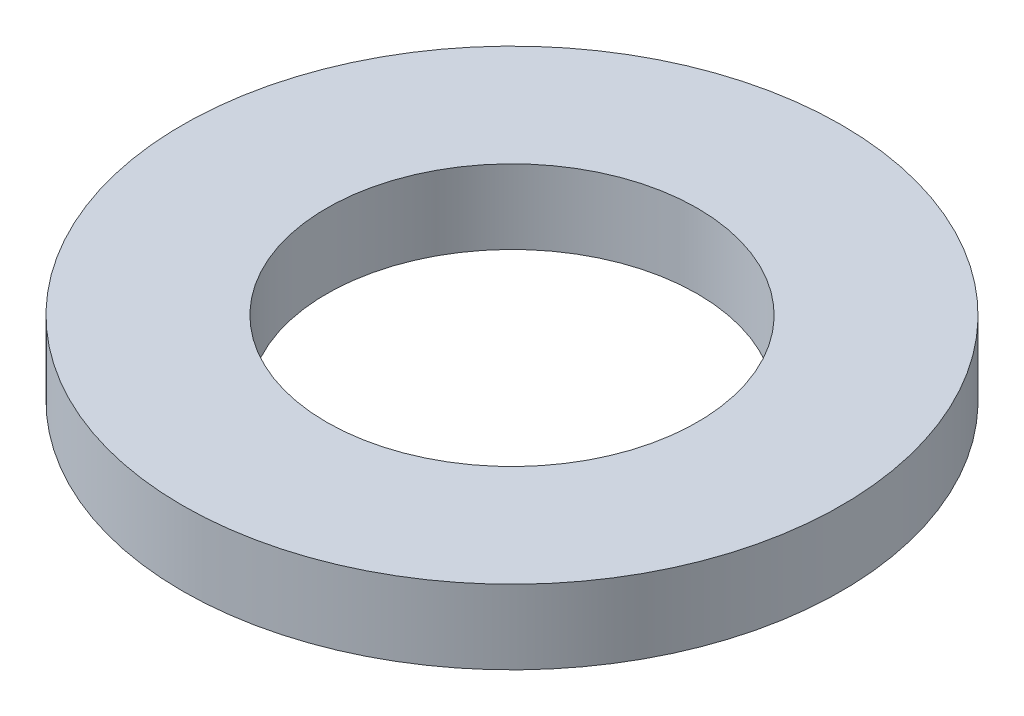
ISO-10303-21;
HEADER;
FILE_DESCRIPTION(('STEP AP214'),'2;1');
FILE_NAME('part.step','',(''),(''),'','','');
FILE_SCHEMA(('AUTOMOTIVE_DESIGN { 1 0 10303 214 1 1 1 1 }'));
ENDSEC;
DATA;
#1=APPLICATION_CONTEXT('core data for automotive mechanical design processes');
#2=APPLICATION_PROTOCOL_DEFINITION('international standard','automotive_design',2000,#1);
#3=PRODUCT_CONTEXT('',#1,'mechanical');
#4=PRODUCT('Part','Part','',(#3));
#5=PRODUCT_RELATED_PRODUCT_CATEGORY('part','',(#4));
#6=PRODUCT_DEFINITION_FORMATION('','',#4);
#7=PRODUCT_DEFINITION_CONTEXT('part definition',#1,'design');
#8=PRODUCT_DEFINITION('design','',#6,#7);
#9=PRODUCT_DEFINITION_SHAPE('','',#8);
#10=(LENGTH_UNIT() NAMED_UNIT(*) SI_UNIT(.MILLI.,.METRE.));
#11=(NAMED_UNIT(*) PLANE_ANGLE_UNIT() SI_UNIT($,.RADIAN.));
#12=(NAMED_UNIT(*) SI_UNIT($,.STERADIAN.) SOLID_ANGLE_UNIT());
#13=UNCERTAINTY_MEASURE_WITH_UNIT(LENGTH_MEASURE(1.E-05),#10,'distance_accuracy_value','');
#14=(GEOMETRIC_REPRESENTATION_CONTEXT(3) GLOBAL_UNCERTAINTY_ASSIGNED_CONTEXT((#13)) GLOBAL_UNIT_ASSIGNED_CONTEXT((#10,
#11,#12)) REPRESENTATION_CONTEXT('',''));
#15=CARTESIAN_POINT('',(0.,0.,0.));
#16=DIRECTION('',(0.,0.,1.));
#17=DIRECTION('',(1.,0.,0.));
#18=AXIS2_PLACEMENT_3D('',#15,#16,#17);
#19=CARTESIAN_POINT('',(0.,18.,0.));
#20=DIRECTION('',(0.,-1.,0.));
#21=DIRECTION('',(0.,0.,-1.));
#22=AXIS2_PLACEMENT_3D('',#19,#20,#21);
#23=CYLINDRICAL_SURFACE('',#22,80.);
#24=CARTESIAN_POINT('',(0.,18.,0.));
#25=DIRECTION('',(0.,1.,0.));
#26=DIRECTION('',(0.,0.,1.));
#27=AXIS2_PLACEMENT_3D('',#24,#25,#26);
#28=CIRCLE('',#27,80.);
#29=CARTESIAN_POINT('',(0.,18.,80.));
#30=VERTEX_POINT('',#29);
#31=EDGE_CURVE('E10',#30,#30,#28,.T.);
#32=ORIENTED_EDGE('',*,*,#31,.F.);
#33=EDGE_LOOP('',(#32));
#34=FACE_BOUND('',#33,.T.);
#35=CARTESIAN_POINT('',(0.,0.,0.));
#36=DIRECTION('',(0.,1.,0.));
#37=DIRECTION('',(0.,0.,1.));
#38=AXIS2_PLACEMENT_3D('',#35,#36,#37);
#39=CIRCLE('',#38,80.);
#40=CARTESIAN_POINT('',(0.,0.,80.));
#41=VERTEX_POINT('',#40);
#42=EDGE_CURVE('E37',#41,#41,#39,.T.);
#43=ORIENTED_EDGE('',*,*,#42,.T.);
#44=EDGE_LOOP('',(#43));
#45=FACE_BOUND('',#44,.T.);
#46=ADVANCED_FACE('F40',(#34,#45),#23,.T.);
#47=CARTESIAN_POINT('',(0.,18.,0.));
#48=DIRECTION('',(0.,1.,0.));
#49=DIRECTION('',(0.,0.,1.));
#50=AXIS2_PLACEMENT_3D('',#47,#48,#49);
#51=PLANE('',#50);
#52=CARTESIAN_POINT('',(0.,18.,0.));
#53=DIRECTION('',(0.,1.,0.));
#54=DIRECTION('',(0.,0.,1.));
#55=AXIS2_PLACEMENT_3D('',#52,#53,#54);
#56=CIRCLE('',#55,45.);
#57=CARTESIAN_POINT('',(0.,18.,45.));
#58=VERTEX_POINT('',#57);
#59=EDGE_CURVE('E50',#58,#58,#56,.T.);
#60=ORIENTED_EDGE('',*,*,#59,.F.);
#61=EDGE_LOOP('',(#60));
#62=FACE_BOUND('',#61,.T.);
#63=ORIENTED_EDGE('',*,*,#31,.T.);
#64=EDGE_LOOP('',(#63));
#65=FACE_BOUND('',#64,.T.);
#66=ADVANCED_FACE('F59',(#62,#65),#51,.T.);
#67=CARTESIAN_POINT('',(0.,0.,0.));
#68=DIRECTION('',(0.,1.,0.));
#69=DIRECTION('',(0.,0.,1.));
#70=AXIS2_PLACEMENT_3D('',#67,#68,#69);
#71=PLANE('',#70);
#72=CARTESIAN_POINT('',(0.,0.,0.));
#73=DIRECTION('',(0.,1.,0.));
#74=DIRECTION('',(0.,0.,1.));
#75=AXIS2_PLACEMENT_3D('',#72,#73,#74);
#76=CIRCLE('',#75,45.);
#77=CARTESIAN_POINT('',(0.,0.,45.));
#78=VERTEX_POINT('',#77);
#79=EDGE_CURVE('E47',#78,#78,#76,.T.);
#80=ORIENTED_EDGE('',*,*,#79,.T.);
#81=EDGE_LOOP('',(#80));
#82=FACE_BOUND('',#81,.T.);
#83=ORIENTED_EDGE('',*,*,#42,.F.);
#84=EDGE_LOOP('',(#83));
#85=FACE_BOUND('',#84,.T.);
#86=ADVANCED_FACE('F58',(#82,#85),#71,.F.);
#87=CARTESIAN_POINT('',(0.,18.,0.));
#88=DIRECTION('',(0.,-1.,0.));
#89=DIRECTION('',(0.,0.,-1.));
#90=AXIS2_PLACEMENT_3D('',#87,#88,#89);
#91=CYLINDRICAL_SURFACE('',#90,45.);
#92=ORIENTED_EDGE('',*,*,#59,.T.);
#93=EDGE_LOOP('',(#92));
#94=FACE_BOUND('',#93,.T.);
#95=ORIENTED_EDGE('',*,*,#79,.F.);
#96=EDGE_LOOP('',(#95));
#97=FACE_BOUND('',#96,.T.);
#98=ADVANCED_FACE('F54',(#94,#97),#91,.F.);
#99=CLOSED_SHELL('',(#46,#66,#86,#98));
#100=MANIFOLD_SOLID_BREP('B2',#99);
#101=ADVANCED_BREP_SHAPE_REPRESENTATION('',(#18,#100),#14);
#102=SHAPE_DEFINITION_REPRESENTATION(#9,#101);
ENDSEC;
END-ISO-10303-21;
